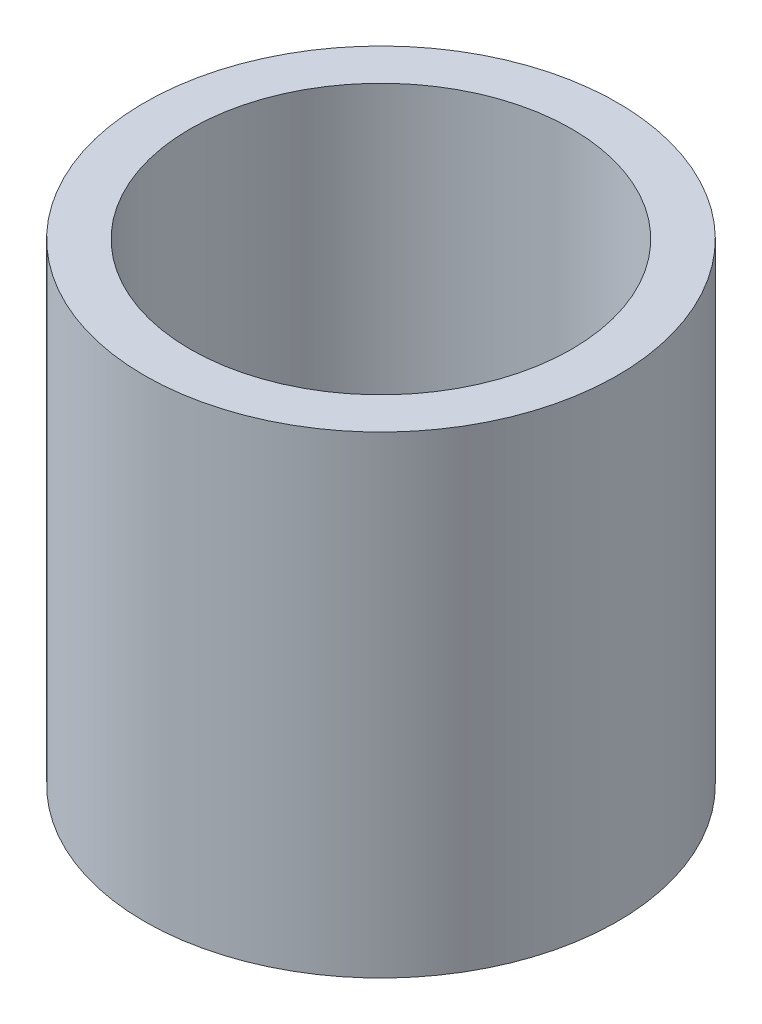
ISO-10303-21;
HEADER;
FILE_DESCRIPTION(('STEP AP214'),'2;1');
FILE_NAME('part.step','',(''),(''),'','','');
FILE_SCHEMA(('AUTOMOTIVE_DESIGN { 1 0 10303 214 1 1 1 1 }'));
ENDSEC;
DATA;
#1=APPLICATION_CONTEXT('core data for automotive mechanical design processes');
#2=APPLICATION_PROTOCOL_DEFINITION('international standard','automotive_design',2000,#1);
#3=PRODUCT_CONTEXT('',#1,'mechanical');
#4=PRODUCT('Part','Part','',(#3));
#5=PRODUCT_RELATED_PRODUCT_CATEGORY('part','',(#4));
#6=PRODUCT_DEFINITION_FORMATION('','',#4);
#7=PRODUCT_DEFINITION_CONTEXT('part definition',#1,'design');
#8=PRODUCT_DEFINITION('design','',#6,#7);
#9=PRODUCT_DEFINITION_SHAPE('','',#8);
#10=(LENGTH_UNIT() NAMED_UNIT(*) SI_UNIT(.MILLI.,.METRE.));
#11=(NAMED_UNIT(*) PLANE_ANGLE_UNIT() SI_UNIT($,.RADIAN.));
#12=(NAMED_UNIT(*) SI_UNIT($,.STERADIAN.) SOLID_ANGLE_UNIT());
#13=UNCERTAINTY_MEASURE_WITH_UNIT(LENGTH_MEASURE(1.E-05),#10,'distance_accuracy_value','');
#14=(GEOMETRIC_REPRESENTATION_CONTEXT(3) GLOBAL_UNCERTAINTY_ASSIGNED_CONTEXT((#13)) GLOBAL_UNIT_ASSIGNED_CONTEXT((#10,
#11,#12)) REPRESENTATION_CONTEXT('',''));
#15=CARTESIAN_POINT('',(0.,0.,0.));
#16=DIRECTION('',(0.,0.,1.));
#17=DIRECTION('',(1.,0.,0.));
#18=AXIS2_PLACEMENT_3D('',#15,#16,#17);
#19=CARTESIAN_POINT('',(20.5,0.,0.));
#20=DIRECTION('',(0.,1.,0.));
#21=DIRECTION('',(0.,0.,1.));
#22=AXIS2_PLACEMENT_3D('',#19,#20,#21);
#23=PLANE('',#22);
#24=CARTESIAN_POINT('',(0.,0.,0.));
#25=DIRECTION('',(0.,1.,0.));
#26=DIRECTION('',(0.,0.,1.));
#27=AXIS2_PLACEMENT_3D('',#24,#25,#26);
#28=CIRCLE('',#27,25.4);
#29=CARTESIAN_POINT('',(0.,0.,25.4));
#30=VERTEX_POINT('',#29);
#31=EDGE_CURVE('E10',#30,#30,#28,.T.);
#32=ORIENTED_EDGE('',*,*,#31,.F.);
#33=EDGE_LOOP('',(#32));
#34=FACE_BOUND('',#33,.T.);
#35=CARTESIAN_POINT('',(0.,0.,0.));
#36=DIRECTION('',(0.,1.,0.));
#37=DIRECTION('',(0.,0.,1.));
#38=AXIS2_PLACEMENT_3D('',#35,#36,#37);
#39=CIRCLE('',#38,20.5);
#40=CARTESIAN_POINT('',(0.,0.,20.5));
#41=VERTEX_POINT('',#40);
#42=EDGE_CURVE('E51',#41,#41,#39,.T.);
#43=ORIENTED_EDGE('',*,*,#42,.T.);
#44=EDGE_LOOP('',(#43));
#45=FACE_BOUND('',#44,.T.);
#46=ADVANCED_FACE('F37',(#34,#45),#23,.F.);
#47=CARTESIAN_POINT('',(0.,161.376166943427,0.));
#48=DIRECTION('',(0.,1.,0.));
#49=DIRECTION('',(0.,0.,1.));
#50=AXIS2_PLACEMENT_3D('',#47,#48,#49);
#51=CYLINDRICAL_SURFACE('',#50,25.4);
#52=CARTESIAN_POINT('',(0.,50.8,0.));
#53=DIRECTION('',(0.,1.,0.));
#54=DIRECTION('',(0.,0.,1.));
#55=AXIS2_PLACEMENT_3D('',#52,#53,#54);
#56=CIRCLE('',#55,25.4);
#57=CARTESIAN_POINT('',(0.,50.8,25.4));
#58=VERTEX_POINT('',#57);
#59=EDGE_CURVE('E43',#58,#58,#56,.T.);
#60=ORIENTED_EDGE('',*,*,#59,.F.);
#61=EDGE_LOOP('',(#60));
#62=FACE_BOUND('',#61,.T.);
#63=ORIENTED_EDGE('',*,*,#31,.T.);
#64=EDGE_LOOP('',(#63));
#65=FACE_BOUND('',#64,.T.);
#66=ADVANCED_FACE('F66',(#62,#65),#51,.T.);
#67=CARTESIAN_POINT('',(20.5,50.8,0.));
#68=DIRECTION('',(0.,-1.,0.));
#69=DIRECTION('',(0.,0.,-1.));
#70=AXIS2_PLACEMENT_3D('',#67,#68,#69);
#71=PLANE('',#70);
#72=CARTESIAN_POINT('',(0.,50.8,0.));
#73=DIRECTION('',(0.,1.,0.));
#74=DIRECTION('',(0.,0.,1.));
#75=AXIS2_PLACEMENT_3D('',#72,#73,#74);
#76=CIRCLE('',#75,20.5);
#77=CARTESIAN_POINT('',(0.,50.8,20.5));
#78=VERTEX_POINT('',#77);
#79=EDGE_CURVE('E47',#78,#78,#76,.T.);
#80=ORIENTED_EDGE('',*,*,#79,.F.);
#81=EDGE_LOOP('',(#80));
#82=FACE_BOUND('',#81,.T.);
#83=ORIENTED_EDGE('',*,*,#59,.T.);
#84=EDGE_LOOP('',(#83));
#85=FACE_BOUND('',#84,.T.);
#86=ADVANCED_FACE('F61',(#82,#85),#71,.F.);
#87=CARTESIAN_POINT('',(0.,161.376166943427,0.));
#88=DIRECTION('',(0.,1.,0.));
#89=DIRECTION('',(0.,0.,1.));
#90=AXIS2_PLACEMENT_3D('',#87,#88,#89);
#91=CYLINDRICAL_SURFACE('',#90,20.5);
#92=ORIENTED_EDGE('',*,*,#42,.F.);
#93=EDGE_LOOP('',(#92));
#94=FACE_BOUND('',#93,.T.);
#95=ORIENTED_EDGE('',*,*,#79,.T.);
#96=EDGE_LOOP('',(#95));
#97=FACE_BOUND('',#96,.T.);
#98=ADVANCED_FACE('F58',(#94,#97),#91,.F.);
#99=CLOSED_SHELL('',(#46,#66,#86,#98));
#100=MANIFOLD_SOLID_BREP('B2',#99);
#101=ADVANCED_BREP_SHAPE_REPRESENTATION('',(#18,#100),#14);
#102=SHAPE_DEFINITION_REPRESENTATION(#9,#101);
ENDSEC;
END-ISO-10303-21;
